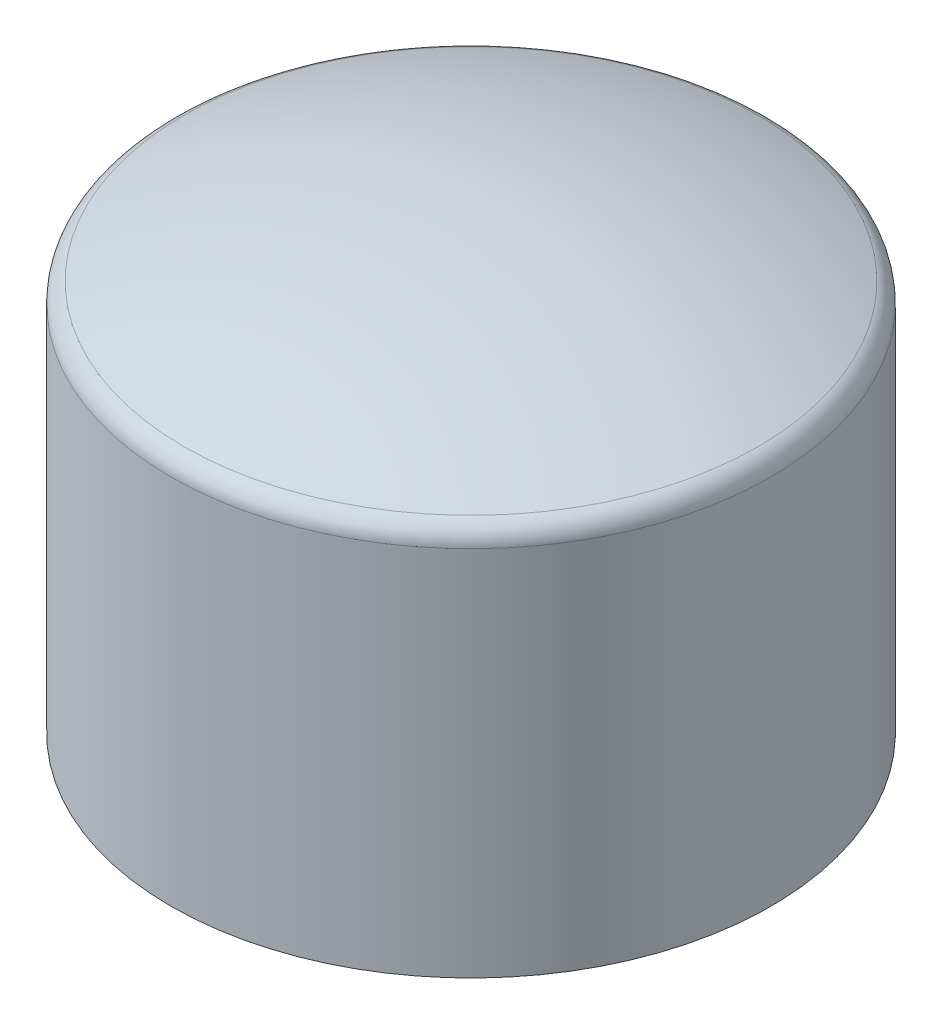
ISO-10303-21;
HEADER;
FILE_DESCRIPTION(('STEP AP214'),'2;1');
FILE_NAME('part.step','',(''),(''),'','','');
FILE_SCHEMA(('AUTOMOTIVE_DESIGN { 1 0 10303 214 1 1 1 1 }'));
ENDSEC;
DATA;
#1=APPLICATION_CONTEXT('core data for automotive mechanical design processes');
#2=APPLICATION_PROTOCOL_DEFINITION('international standard','automotive_design',2000,#1);
#3=PRODUCT_CONTEXT('',#1,'mechanical');
#4=PRODUCT('Part','Part','',(#3));
#5=PRODUCT_RELATED_PRODUCT_CATEGORY('part','',(#4));
#6=PRODUCT_DEFINITION_FORMATION('','',#4);
#7=PRODUCT_DEFINITION_CONTEXT('part definition',#1,'design');
#8=PRODUCT_DEFINITION('design','',#6,#7);
#9=PRODUCT_DEFINITION_SHAPE('','',#8);
#10=(LENGTH_UNIT() NAMED_UNIT(*) SI_UNIT(.MILLI.,.METRE.));
#11=(NAMED_UNIT(*) PLANE_ANGLE_UNIT() SI_UNIT($,.RADIAN.));
#12=(NAMED_UNIT(*) SI_UNIT($,.STERADIAN.) SOLID_ANGLE_UNIT());
#13=UNCERTAINTY_MEASURE_WITH_UNIT(LENGTH_MEASURE(1.E-05),#10,'distance_accuracy_value','');
#14=(GEOMETRIC_REPRESENTATION_CONTEXT(3) GLOBAL_UNCERTAINTY_ASSIGNED_CONTEXT((#13)) GLOBAL_UNIT_ASSIGNED_CONTEXT((#10,
#11,#12)) REPRESENTATION_CONTEXT('',''));
#15=CARTESIAN_POINT('',(0.,0.,0.));
#16=DIRECTION('',(0.,0.,1.));
#17=DIRECTION('',(1.,0.,0.));
#18=AXIS2_PLACEMENT_3D('',#15,#16,#17);
#19=CARTESIAN_POINT('',(0.,-6.58333333333332,0.));
#20=DIRECTION('',(0.,-1.,0.));
#21=DIRECTION('',(0.,0.,-1.));
#22=AXIS2_PLACEMENT_3D('',#19,#20,#21);
#23=SPHERICAL_SURFACE('',#22,17.0833333333333);
#24=CARTESIAN_POINT('',(0.,9.1330317350692,0.));
#25=DIRECTION('',(0.,-1.,0.));
#26=DIRECTION('',(0.,0.,-1.));
#27=AXIS2_PLACEMENT_3D('',#24,#25,#26);
#28=CIRCLE('',#27,6.69597989949749);
#29=CARTESIAN_POINT('',(0.,9.1330317350692,-6.69597989949749));
#30=VERTEX_POINT('',#29);
#31=EDGE_CURVE('E10',#30,#30,#28,.F.);
#32=ORIENTED_EDGE('',*,*,#31,.T.);
#33=EDGE_LOOP('',(#32));
#34=FACE_BOUND('',#33,.T.);
#35=ADVANCED_FACE('F35',(#34),#23,.T.);
#36=CARTESIAN_POINT('',(0.,0.,0.));
#37=DIRECTION('',(0.,-1.,0.));
#38=DIRECTION('',(0.,0.,-1.));
#39=AXIS2_PLACEMENT_3D('',#36,#37,#38);
#40=CYLINDRICAL_SURFACE('',#39,7.);
#41=CARTESIAN_POINT('',(0.,8.67304056233547,0.));
#42=DIRECTION('',(0.,-1.,0.));
#43=DIRECTION('',(0.,0.,-1.));
#44=AXIS2_PLACEMENT_3D('',#41,#42,#43);
#45=CIRCLE('',#44,7.);
#46=CARTESIAN_POINT('',(0.,8.67304056233547,-7.));
#47=VERTEX_POINT('',#46);
#48=EDGE_CURVE('E42',#47,#47,#45,.T.);
#49=ORIENTED_EDGE('',*,*,#48,.T.);
#50=EDGE_LOOP('',(#49));
#51=FACE_BOUND('',#50,.T.);
#52=CARTESIAN_POINT('',(0.,0.,0.));
#53=DIRECTION('',(0.,-1.,0.));
#54=DIRECTION('',(0.,0.,-1.));
#55=AXIS2_PLACEMENT_3D('',#52,#53,#54);
#56=CIRCLE('',#55,7.);
#57=CARTESIAN_POINT('',(0.,0.,-7.));
#58=VERTEX_POINT('',#57);
#59=EDGE_CURVE('E46',#58,#58,#56,.T.);
#60=ORIENTED_EDGE('',*,*,#59,.F.);
#61=EDGE_LOOP('',(#60));
#62=FACE_BOUND('',#61,.T.);
#63=ADVANCED_FACE('F55',(#51,#62),#40,.T.);
#64=CARTESIAN_POINT('',(0.,0.,0.));
#65=DIRECTION('',(0.,-1.,0.));
#66=DIRECTION('',(0.,0.,-1.));
#67=AXIS2_PLACEMENT_3D('',#64,#65,#66);
#68=PLANE('',#67);
#69=ORIENTED_EDGE('',*,*,#59,.T.);
#70=EDGE_LOOP('',(#69));
#71=FACE_BOUND('',#70,.T.);
#72=ADVANCED_FACE('F53',(#71),#68,.T.);
#73=CARTESIAN_POINT('',(0.,8.67304056233547,0.));
#74=DIRECTION('',(0.,-1.,0.));
#75=DIRECTION('',(0.,0.,-1.));
#76=AXIS2_PLACEMENT_3D('',#73,#74,#75);
#77=TOROIDAL_SURFACE('',#76,6.5,0.5);
#78=ORIENTED_EDGE('',*,*,#31,.F.);
#79=EDGE_LOOP('',(#78));
#80=FACE_BOUND('',#79,.T.);
#81=ORIENTED_EDGE('',*,*,#48,.F.);
#82=EDGE_LOOP('',(#81));
#83=FACE_BOUND('',#82,.T.);
#84=ADVANCED_FACE('F37',(#80,#83),#77,.T.);
#85=CLOSED_SHELL('',(#35,#63,#72,#84));
#86=MANIFOLD_SOLID_BREP('B2',#85);
#87=ADVANCED_BREP_SHAPE_REPRESENTATION('',(#18,#86),#14);
#88=SHAPE_DEFINITION_REPRESENTATION(#9,#87);
ENDSEC;
END-ISO-10303-21;
